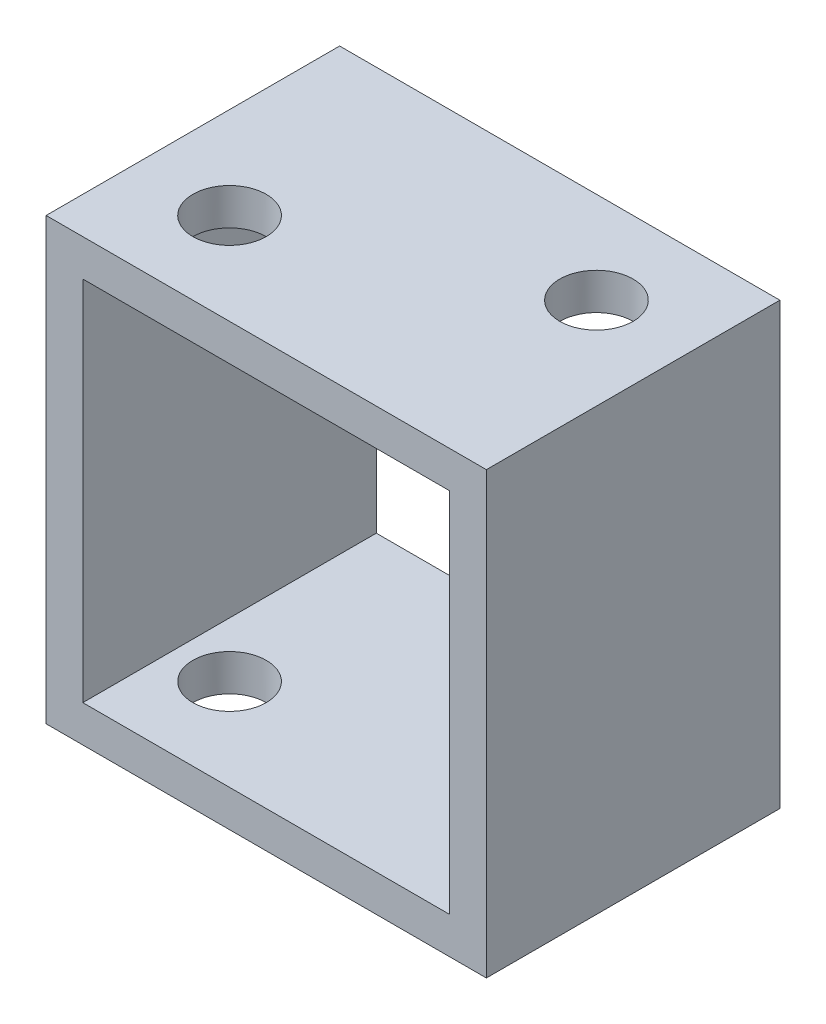
ISO-10303-21;
HEADER;
FILE_DESCRIPTION(('STEP AP214'),'2;1');
FILE_NAME('part.step','',(''),(''),'','','');
FILE_SCHEMA(('AUTOMOTIVE_DESIGN { 1 0 10303 214 1 1 1 1 }'));
ENDSEC;
DATA;
#1=APPLICATION_CONTEXT('core data for automotive mechanical design processes');
#2=APPLICATION_PROTOCOL_DEFINITION('international standard','automotive_design',2000,#1);
#3=PRODUCT_CONTEXT('',#1,'mechanical');
#4=PRODUCT('Part','Part','',(#3));
#5=PRODUCT_RELATED_PRODUCT_CATEGORY('part','',(#4));
#6=PRODUCT_DEFINITION_FORMATION('','',#4);
#7=PRODUCT_DEFINITION_CONTEXT('part definition',#1,'design');
#8=PRODUCT_DEFINITION('design','',#6,#7);
#9=PRODUCT_DEFINITION_SHAPE('','',#8);
#10=(LENGTH_UNIT() NAMED_UNIT(*) SI_UNIT(.MILLI.,.METRE.));
#11=(NAMED_UNIT(*) PLANE_ANGLE_UNIT() SI_UNIT($,.RADIAN.));
#12=(NAMED_UNIT(*) SI_UNIT($,.STERADIAN.) SOLID_ANGLE_UNIT());
#13=UNCERTAINTY_MEASURE_WITH_UNIT(LENGTH_MEASURE(1.E-05),#10,'distance_accuracy_value','');
#14=(GEOMETRIC_REPRESENTATION_CONTEXT(3) GLOBAL_UNCERTAINTY_ASSIGNED_CONTEXT((#13)) GLOBAL_UNIT_ASSIGNED_CONTEXT((#10,
#11,#12)) REPRESENTATION_CONTEXT('',''));
#15=CARTESIAN_POINT('',(0.,0.,0.));
#16=DIRECTION('',(0.,0.,1.));
#17=DIRECTION('',(1.,0.,0.));
#18=AXIS2_PLACEMENT_3D('',#15,#16,#17);
#19=CARTESIAN_POINT('',(0.,0.,25.4));
#20=DIRECTION('',(0.,0.,-1.));
#21=DIRECTION('',(-1.,0.,0.));
#22=AXIS2_PLACEMENT_3D('',#19,#20,#21);
#23=PLANE('',#22);
#24=DIRECTION('',(1.,0.,0.));
#25=VECTOR('',#24,1.);
#26=CARTESIAN_POINT('',(38.1,0.,25.4));
#27=LINE('',#26,#25);
#28=CARTESIAN_POINT('',(0.,0.,25.4));
#29=VERTEX_POINT('',#28);
#30=CARTESIAN_POINT('',(38.1,0.,25.4));
#31=VERTEX_POINT('',#30);
#32=EDGE_CURVE('E137',#29,#31,#27,.T.);
#33=ORIENTED_EDGE('',*,*,#32,.T.);
#34=DIRECTION('',(0.,1.,0.));
#35=VECTOR('',#34,1.);
#36=CARTESIAN_POINT('',(38.1,38.1,25.4));
#37=LINE('',#36,#35);
#38=CARTESIAN_POINT('',(38.1,38.1,25.4));
#39=VERTEX_POINT('',#38);
#40=EDGE_CURVE('E140',#31,#39,#37,.T.);
#41=ORIENTED_EDGE('',*,*,#40,.T.);
#42=DIRECTION('',(-1.,0.,0.));
#43=VECTOR('',#42,1.);
#44=CARTESIAN_POINT('',(0.,38.1,25.4));
#45=LINE('',#44,#43);
#46=CARTESIAN_POINT('',(0.,38.1,25.4));
#47=VERTEX_POINT('',#46);
#48=EDGE_CURVE('E143',#39,#47,#45,.T.);
#49=ORIENTED_EDGE('',*,*,#48,.T.);
#50=DIRECTION('',(0.,-1.,0.));
#51=VECTOR('',#50,1.);
#52=CARTESIAN_POINT('',(0.,0.,25.4));
#53=LINE('',#52,#51);
#54=EDGE_CURVE('E145',#47,#29,#53,.T.);
#55=ORIENTED_EDGE('',*,*,#54,.T.);
#56=EDGE_LOOP('',(#33,#41,#49,#55));
#57=FACE_BOUND('',#56,.T.);
#58=DIRECTION('',(0.,-1.,0.));
#59=VECTOR('',#58,1.);
#60=CARTESIAN_POINT('',(3.175,3.175,25.4));
#61=LINE('',#60,#59);
#62=CARTESIAN_POINT('',(3.175,34.925,25.4));
#63=VERTEX_POINT('',#62);
#64=CARTESIAN_POINT('',(3.175,3.175,25.4));
#65=VERTEX_POINT('',#64);
#66=EDGE_CURVE('E99',#63,#65,#61,.T.);
#67=ORIENTED_EDGE('',*,*,#66,.F.);
#68=DIRECTION('',(-1.,0.,0.));
#69=VECTOR('',#68,1.);
#70=CARTESIAN_POINT('',(3.175,34.925,25.4));
#71=LINE('',#70,#69);
#72=CARTESIAN_POINT('',(34.925,34.925,25.4));
#73=VERTEX_POINT('',#72);
#74=EDGE_CURVE('E121',#73,#63,#71,.T.);
#75=ORIENTED_EDGE('',*,*,#74,.F.);
#76=DIRECTION('',(0.,1.,0.));
#77=VECTOR('',#76,1.);
#78=CARTESIAN_POINT('',(34.925,34.925,25.4));
#79=LINE('',#78,#77);
#80=CARTESIAN_POINT('',(34.925,3.175,25.4));
#81=VERTEX_POINT('',#80);
#82=EDGE_CURVE('E119',#81,#73,#79,.T.);
#83=ORIENTED_EDGE('',*,*,#82,.F.);
#84=DIRECTION('',(1.,0.,0.));
#85=VECTOR('',#84,1.);
#86=CARTESIAN_POINT('',(34.925,3.175,25.4));
#87=LINE('',#86,#85);
#88=EDGE_CURVE('E107',#65,#81,#87,.T.);
#89=ORIENTED_EDGE('',*,*,#88,.F.);
#90=EDGE_LOOP('',(#67,#75,#83,#89));
#91=FACE_BOUND('',#90,.T.);
#92=ADVANCED_FACE('F32',(#57,#91),#23,.F.);
#93=CARTESIAN_POINT('',(0.,0.,0.));
#94=DIRECTION('',(0.,0.,-1.));
#95=DIRECTION('',(-1.,0.,0.));
#96=AXIS2_PLACEMENT_3D('',#93,#94,#95);
#97=PLANE('',#96);
#98=DIRECTION('',(1.,0.,0.));
#99=VECTOR('',#98,1.);
#100=CARTESIAN_POINT('',(38.1,0.,0.));
#101=LINE('',#100,#99);
#102=CARTESIAN_POINT('',(0.,0.,0.));
#103=VERTEX_POINT('',#102);
#104=CARTESIAN_POINT('',(38.1,0.,0.));
#105=VERTEX_POINT('',#104);
#106=EDGE_CURVE('E115',#103,#105,#101,.T.);
#107=ORIENTED_EDGE('',*,*,#106,.F.);
#108=DIRECTION('',(0.,-1.,0.));
#109=VECTOR('',#108,1.);
#110=CARTESIAN_POINT('',(0.,0.,0.));
#111=LINE('',#110,#109);
#112=CARTESIAN_POINT('',(0.,38.1,0.));
#113=VERTEX_POINT('',#112);
#114=EDGE_CURVE('E141',#113,#103,#111,.T.);
#115=ORIENTED_EDGE('',*,*,#114,.F.);
#116=DIRECTION('',(-1.,0.,0.));
#117=VECTOR('',#116,1.);
#118=CARTESIAN_POINT('',(0.,38.1,0.));
#119=LINE('',#118,#117);
#120=CARTESIAN_POINT('',(38.1,38.1,0.));
#121=VERTEX_POINT('',#120);
#122=EDGE_CURVE('E152',#121,#113,#119,.T.);
#123=ORIENTED_EDGE('',*,*,#122,.F.);
#124=DIRECTION('',(0.,1.,0.));
#125=VECTOR('',#124,1.);
#126=CARTESIAN_POINT('',(38.1,38.1,0.));
#127=LINE('',#126,#125);
#128=EDGE_CURVE('E150',#105,#121,#127,.T.);
#129=ORIENTED_EDGE('',*,*,#128,.F.);
#130=EDGE_LOOP('',(#107,#115,#123,#129));
#131=FACE_BOUND('',#130,.T.);
#132=DIRECTION('',(-1.,0.,0.));
#133=VECTOR('',#132,1.);
#134=CARTESIAN_POINT('',(3.175,34.925,0.));
#135=LINE('',#134,#133);
#136=CARTESIAN_POINT('',(34.925,34.925,0.));
#137=VERTEX_POINT('',#136);
#138=CARTESIAN_POINT('',(3.175,34.925,0.));
#139=VERTEX_POINT('',#138);
#140=EDGE_CURVE('E108',#137,#139,#135,.T.);
#141=ORIENTED_EDGE('',*,*,#140,.T.);
#142=DIRECTION('',(0.,-1.,0.));
#143=VECTOR('',#142,1.);
#144=CARTESIAN_POINT('',(3.175,3.175,0.));
#145=LINE('',#144,#143);
#146=CARTESIAN_POINT('',(3.175,3.175,0.));
#147=VERTEX_POINT('',#146);
#148=EDGE_CURVE('E57',#139,#147,#145,.T.);
#149=ORIENTED_EDGE('',*,*,#148,.T.);
#150=DIRECTION('',(1.,0.,0.));
#151=VECTOR('',#150,1.);
#152=CARTESIAN_POINT('',(34.925,3.175,0.));
#153=LINE('',#152,#151);
#154=CARTESIAN_POINT('',(34.925,3.175,0.));
#155=VERTEX_POINT('',#154);
#156=EDGE_CURVE('E114',#147,#155,#153,.T.);
#157=ORIENTED_EDGE('',*,*,#156,.T.);
#158=DIRECTION('',(0.,1.,0.));
#159=VECTOR('',#158,1.);
#160=CARTESIAN_POINT('',(34.925,34.925,0.));
#161=LINE('',#160,#159);
#162=EDGE_CURVE('E129',#155,#137,#161,.T.);
#163=ORIENTED_EDGE('',*,*,#162,.T.);
#164=EDGE_LOOP('',(#141,#149,#157,#163));
#165=FACE_BOUND('',#164,.T.);
#166=ADVANCED_FACE('F199',(#131,#165),#97,.T.);
#167=CARTESIAN_POINT('',(38.1,0.,25.4));
#168=DIRECTION('',(0.,1.,0.));
#169=DIRECTION('',(-1.,0.,0.));
#170=AXIS2_PLACEMENT_3D('',#167,#168,#169);
#171=PLANE('',#170);
#172=CARTESIAN_POINT('',(7.9375,0.,17.4625));
#173=DIRECTION('',(0.,-1.,0.));
#174=DIRECTION('',(1.,0.,0.));
#175=AXIS2_PLACEMENT_3D('',#172,#173,#174);
#176=CIRCLE('',#175,3.175);
#177=CARTESIAN_POINT('',(11.1125,0.,17.4625));
#178=VERTEX_POINT('',#177);
#179=EDGE_CURVE('E170',#178,#178,#176,.T.);
#180=ORIENTED_EDGE('',*,*,#179,.F.);
#181=EDGE_LOOP('',(#180));
#182=FACE_BOUND('',#181,.T.);
#183=CARTESIAN_POINT('',(30.1625,0.,7.9375));
#184=DIRECTION('',(0.,-1.,0.));
#185=DIRECTION('',(1.,0.,0.));
#186=AXIS2_PLACEMENT_3D('',#183,#184,#185);
#187=CIRCLE('',#186,3.175);
#188=CARTESIAN_POINT('',(33.3375,0.,7.9375));
#189=VERTEX_POINT('',#188);
#190=EDGE_CURVE('E180',#189,#189,#187,.T.);
#191=ORIENTED_EDGE('',*,*,#190,.F.);
#192=EDGE_LOOP('',(#191));
#193=FACE_BOUND('',#192,.T.);
#194=ORIENTED_EDGE('',*,*,#106,.T.);
#195=DIRECTION('',(0.,0.,-1.));
#196=VECTOR('',#195,1.);
#197=CARTESIAN_POINT('',(38.1,0.,25.4));
#198=LINE('',#197,#196);
#199=EDGE_CURVE('E11',#31,#105,#198,.T.);
#200=ORIENTED_EDGE('',*,*,#199,.F.);
#201=ORIENTED_EDGE('',*,*,#32,.F.);
#202=DIRECTION('',(0.,0.,-1.));
#203=VECTOR('',#202,1.);
#204=CARTESIAN_POINT('',(0.,0.,25.4));
#205=LINE('',#204,#203);
#206=EDGE_CURVE('E147',#29,#103,#205,.T.);
#207=ORIENTED_EDGE('',*,*,#206,.T.);
#208=EDGE_LOOP('',(#194,#200,#201,#207));
#209=FACE_BOUND('',#208,.T.);
#210=ADVANCED_FACE('F34',(#182,#193,#209),#171,.F.);
#211=CARTESIAN_POINT('',(38.1,38.1,25.4));
#212=DIRECTION('',(-1.,0.,0.));
#213=DIRECTION('',(0.,0.,1.));
#214=AXIS2_PLACEMENT_3D('',#211,#212,#213);
#215=PLANE('',#214);
#216=ORIENTED_EDGE('',*,*,#128,.T.);
#217=DIRECTION('',(0.,0.,-1.));
#218=VECTOR('',#217,1.);
#219=CARTESIAN_POINT('',(38.1,38.1,25.4));
#220=LINE('',#219,#218);
#221=EDGE_CURVE('E41',#39,#121,#220,.T.);
#222=ORIENTED_EDGE('',*,*,#221,.F.);
#223=ORIENTED_EDGE('',*,*,#40,.F.);
#224=ORIENTED_EDGE('',*,*,#199,.T.);
#225=EDGE_LOOP('',(#216,#222,#223,#224));
#226=FACE_BOUND('',#225,.T.);
#227=ADVANCED_FACE('F224',(#226),#215,.F.);
#228=CARTESIAN_POINT('',(0.,38.1,25.4));
#229=DIRECTION('',(0.,-1.,0.));
#230=DIRECTION('',(0.,0.,-1.));
#231=AXIS2_PLACEMENT_3D('',#228,#229,#230);
#232=PLANE('',#231);
#233=CARTESIAN_POINT('',(7.9375,38.1,17.4625));
#234=DIRECTION('',(0.,-1.,0.));
#235=DIRECTION('',(1.,0.,0.));
#236=AXIS2_PLACEMENT_3D('',#233,#234,#235);
#237=CIRCLE('',#236,3.175);
#238=CARTESIAN_POINT('',(11.1125,38.1,17.4625));
#239=VERTEX_POINT('',#238);
#240=EDGE_CURVE('E164',#239,#239,#237,.T.);
#241=ORIENTED_EDGE('',*,*,#240,.T.);
#242=EDGE_LOOP('',(#241));
#243=FACE_BOUND('',#242,.T.);
#244=CARTESIAN_POINT('',(30.1625,38.1,7.9375));
#245=DIRECTION('',(0.,-1.,0.));
#246=DIRECTION('',(1.,0.,0.));
#247=AXIS2_PLACEMENT_3D('',#244,#245,#246);
#248=CIRCLE('',#247,3.175);
#249=CARTESIAN_POINT('',(33.3375,38.1,7.9375));
#250=VERTEX_POINT('',#249);
#251=EDGE_CURVE('E175',#250,#250,#248,.T.);
#252=ORIENTED_EDGE('',*,*,#251,.T.);
#253=EDGE_LOOP('',(#252));
#254=FACE_BOUND('',#253,.T.);
#255=ORIENTED_EDGE('',*,*,#122,.T.);
#256=DIRECTION('',(0.,0.,-1.));
#257=VECTOR('',#256,1.);
#258=CARTESIAN_POINT('',(0.,38.1,25.4));
#259=LINE('',#258,#257);
#260=EDGE_CURVE('E157',#47,#113,#259,.T.);
#261=ORIENTED_EDGE('',*,*,#260,.F.);
#262=ORIENTED_EDGE('',*,*,#48,.F.);
#263=ORIENTED_EDGE('',*,*,#221,.T.);
#264=EDGE_LOOP('',(#255,#261,#262,#263));
#265=FACE_BOUND('',#264,.T.);
#266=ADVANCED_FACE('F221',(#243,#254,#265),#232,.F.);
#267=CARTESIAN_POINT('',(0.,0.,25.4));
#268=DIRECTION('',(1.,0.,0.));
#269=DIRECTION('',(0.,1.,0.));
#270=AXIS2_PLACEMENT_3D('',#267,#268,#269);
#271=PLANE('',#270);
#272=ORIENTED_EDGE('',*,*,#114,.T.);
#273=ORIENTED_EDGE('',*,*,#206,.F.);
#274=ORIENTED_EDGE('',*,*,#54,.F.);
#275=ORIENTED_EDGE('',*,*,#260,.T.);
#276=EDGE_LOOP('',(#272,#273,#274,#275));
#277=FACE_BOUND('',#276,.T.);
#278=ADVANCED_FACE('F218',(#277),#271,.F.);
#279=CARTESIAN_POINT('',(3.175,3.175,25.4));
#280=DIRECTION('',(1.,0.,0.));
#281=DIRECTION('',(0.,0.,-1.));
#282=AXIS2_PLACEMENT_3D('',#279,#280,#281);
#283=PLANE('',#282);
#284=ORIENTED_EDGE('',*,*,#148,.F.);
#285=DIRECTION('',(0.,0.,-1.));
#286=VECTOR('',#285,1.);
#287=CARTESIAN_POINT('',(3.175,34.925,25.4));
#288=LINE('',#287,#286);
#289=EDGE_CURVE('E103',#63,#139,#288,.T.);
#290=ORIENTED_EDGE('',*,*,#289,.F.);
#291=ORIENTED_EDGE('',*,*,#66,.T.);
#292=DIRECTION('',(0.,0.,-1.));
#293=VECTOR('',#292,1.);
#294=CARTESIAN_POINT('',(3.175,3.175,25.4));
#295=LINE('',#294,#293);
#296=EDGE_CURVE('E102',#65,#147,#295,.T.);
#297=ORIENTED_EDGE('',*,*,#296,.T.);
#298=EDGE_LOOP('',(#284,#290,#291,#297));
#299=FACE_BOUND('',#298,.T.);
#300=ADVANCED_FACE('F101',(#299),#283,.T.);
#301=CARTESIAN_POINT('',(34.925,3.175,25.4));
#302=DIRECTION('',(0.,1.,0.));
#303=DIRECTION('',(-1.,0.,0.));
#304=AXIS2_PLACEMENT_3D('',#301,#302,#303);
#305=PLANE('',#304);
#306=CARTESIAN_POINT('',(7.9375,3.175,17.4625));
#307=DIRECTION('',(0.,1.,0.));
#308=DIRECTION('',(-1.,0.,0.));
#309=AXIS2_PLACEMENT_3D('',#306,#307,#308);
#310=CIRCLE('',#309,3.175);
#311=CARTESIAN_POINT('',(4.7625,3.175,17.4625));
#312=VERTEX_POINT('',#311);
#313=EDGE_CURVE('E127',#312,#312,#310,.T.);
#314=ORIENTED_EDGE('',*,*,#313,.F.);
#315=EDGE_LOOP('',(#314));
#316=FACE_BOUND('',#315,.T.);
#317=CARTESIAN_POINT('',(30.1625,3.175,7.9375));
#318=DIRECTION('',(0.,1.,0.));
#319=DIRECTION('',(-1.,0.,0.));
#320=AXIS2_PLACEMENT_3D('',#317,#318,#319);
#321=CIRCLE('',#320,3.175);
#322=CARTESIAN_POINT('',(26.9875,3.175,7.9375));
#323=VERTEX_POINT('',#322);
#324=EDGE_CURVE('E163',#323,#323,#321,.T.);
#325=ORIENTED_EDGE('',*,*,#324,.F.);
#326=EDGE_LOOP('',(#325));
#327=FACE_BOUND('',#326,.T.);
#328=ORIENTED_EDGE('',*,*,#156,.F.);
#329=ORIENTED_EDGE('',*,*,#296,.F.);
#330=ORIENTED_EDGE('',*,*,#88,.T.);
#331=DIRECTION('',(0.,0.,-1.));
#332=VECTOR('',#331,1.);
#333=CARTESIAN_POINT('',(34.925,3.175,25.4));
#334=LINE('',#333,#332);
#335=EDGE_CURVE('E116',#81,#155,#334,.T.);
#336=ORIENTED_EDGE('',*,*,#335,.T.);
#337=EDGE_LOOP('',(#328,#329,#330,#336));
#338=FACE_BOUND('',#337,.T.);
#339=ADVANCED_FACE('F111',(#316,#327,#338),#305,.T.);
#340=CARTESIAN_POINT('',(34.925,34.925,25.4));
#341=DIRECTION('',(-1.,0.,0.));
#342=DIRECTION('',(0.,-1.,0.));
#343=AXIS2_PLACEMENT_3D('',#340,#341,#342);
#344=PLANE('',#343);
#345=ORIENTED_EDGE('',*,*,#162,.F.);
#346=ORIENTED_EDGE('',*,*,#335,.F.);
#347=ORIENTED_EDGE('',*,*,#82,.T.);
#348=DIRECTION('',(0.,0.,-1.));
#349=VECTOR('',#348,1.);
#350=CARTESIAN_POINT('',(34.925,34.925,25.4));
#351=LINE('',#350,#349);
#352=EDGE_CURVE('E49',#73,#137,#351,.T.);
#353=ORIENTED_EDGE('',*,*,#352,.T.);
#354=EDGE_LOOP('',(#345,#346,#347,#353));
#355=FACE_BOUND('',#354,.T.);
#356=ADVANCED_FACE('F195',(#355),#344,.T.);
#357=CARTESIAN_POINT('',(3.175,34.925,25.4));
#358=DIRECTION('',(0.,-1.,0.));
#359=DIRECTION('',(0.,0.,-1.));
#360=AXIS2_PLACEMENT_3D('',#357,#358,#359);
#361=PLANE('',#360);
#362=CARTESIAN_POINT('',(7.9375,34.925,17.4625));
#363=DIRECTION('',(0.,-1.,0.));
#364=DIRECTION('',(0.,0.,-1.));
#365=AXIS2_PLACEMENT_3D('',#362,#363,#364);
#366=CIRCLE('',#365,3.175);
#367=CARTESIAN_POINT('',(7.9375,34.925,14.2875));
#368=VERTEX_POINT('',#367);
#369=EDGE_CURVE('E36',#368,#368,#366,.T.);
#370=ORIENTED_EDGE('',*,*,#369,.F.);
#371=EDGE_LOOP('',(#370));
#372=FACE_BOUND('',#371,.T.);
#373=CARTESIAN_POINT('',(30.1625,34.925,7.9375));
#374=DIRECTION('',(0.,-1.,0.));
#375=DIRECTION('',(0.,0.,-1.));
#376=AXIS2_PLACEMENT_3D('',#373,#374,#375);
#377=CIRCLE('',#376,3.175);
#378=CARTESIAN_POINT('',(30.1625,34.925,4.7625));
#379=VERTEX_POINT('',#378);
#380=EDGE_CURVE('E161',#379,#379,#377,.T.);
#381=ORIENTED_EDGE('',*,*,#380,.F.);
#382=EDGE_LOOP('',(#381));
#383=FACE_BOUND('',#382,.T.);
#384=ORIENTED_EDGE('',*,*,#140,.F.);
#385=ORIENTED_EDGE('',*,*,#352,.F.);
#386=ORIENTED_EDGE('',*,*,#74,.T.);
#387=ORIENTED_EDGE('',*,*,#289,.T.);
#388=EDGE_LOOP('',(#384,#385,#386,#387));
#389=FACE_BOUND('',#388,.T.);
#390=ADVANCED_FACE('F191',(#372,#383,#389),#361,.T.);
#391=CARTESIAN_POINT('',(30.1625,38.1,7.9375));
#392=DIRECTION('',(0.,-1.,0.));
#393=DIRECTION('',(1.,0.,0.));
#394=AXIS2_PLACEMENT_3D('',#391,#392,#393);
#395=CYLINDRICAL_SURFACE('',#394,3.175);
#396=ORIENTED_EDGE('',*,*,#380,.T.);
#397=EDGE_LOOP('',(#396));
#398=FACE_BOUND('',#397,.T.);
#399=ORIENTED_EDGE('',*,*,#251,.F.);
#400=EDGE_LOOP('',(#399));
#401=FACE_BOUND('',#400,.T.);
#402=ADVANCED_FACE('F194',(#398,#401),#395,.F.);
#403=CARTESIAN_POINT('',(7.9375,38.1,17.4625));
#404=DIRECTION('',(0.,-1.,0.));
#405=DIRECTION('',(1.,0.,0.));
#406=AXIS2_PLACEMENT_3D('',#403,#404,#405);
#407=CYLINDRICAL_SURFACE('',#406,3.175);
#408=ORIENTED_EDGE('',*,*,#369,.T.);
#409=EDGE_LOOP('',(#408));
#410=FACE_BOUND('',#409,.T.);
#411=ORIENTED_EDGE('',*,*,#240,.F.);
#412=EDGE_LOOP('',(#411));
#413=FACE_BOUND('',#412,.T.);
#414=ADVANCED_FACE('F188',(#410,#413),#407,.F.);
#415=ORIENTED_EDGE('',*,*,#324,.T.);
#416=EDGE_LOOP('',(#415));
#417=FACE_BOUND('',#416,.T.);
#418=ORIENTED_EDGE('',*,*,#190,.T.);
#419=EDGE_LOOP('',(#418));
#420=FACE_BOUND('',#419,.T.);
#421=ADVANCED_FACE('F249',(#417,#420),#395,.F.);
#422=ORIENTED_EDGE('',*,*,#313,.T.);
#423=EDGE_LOOP('',(#422));
#424=FACE_BOUND('',#423,.T.);
#425=ORIENTED_EDGE('',*,*,#179,.T.);
#426=EDGE_LOOP('',(#425));
#427=FACE_BOUND('',#426,.T.);
#428=ADVANCED_FACE('F251',(#424,#427),#407,.F.);
#429=CLOSED_SHELL('',(#92,#166,#210,#227,#266,#278,#300,#339,#356,#390,#402,#414,#421,#428));
#430=MANIFOLD_SOLID_BREP('B2',#429);
#431=ADVANCED_BREP_SHAPE_REPRESENTATION('',(#18,#430),#14);
#432=SHAPE_DEFINITION_REPRESENTATION(#9,#431);
ENDSEC;
END-ISO-10303-21;
